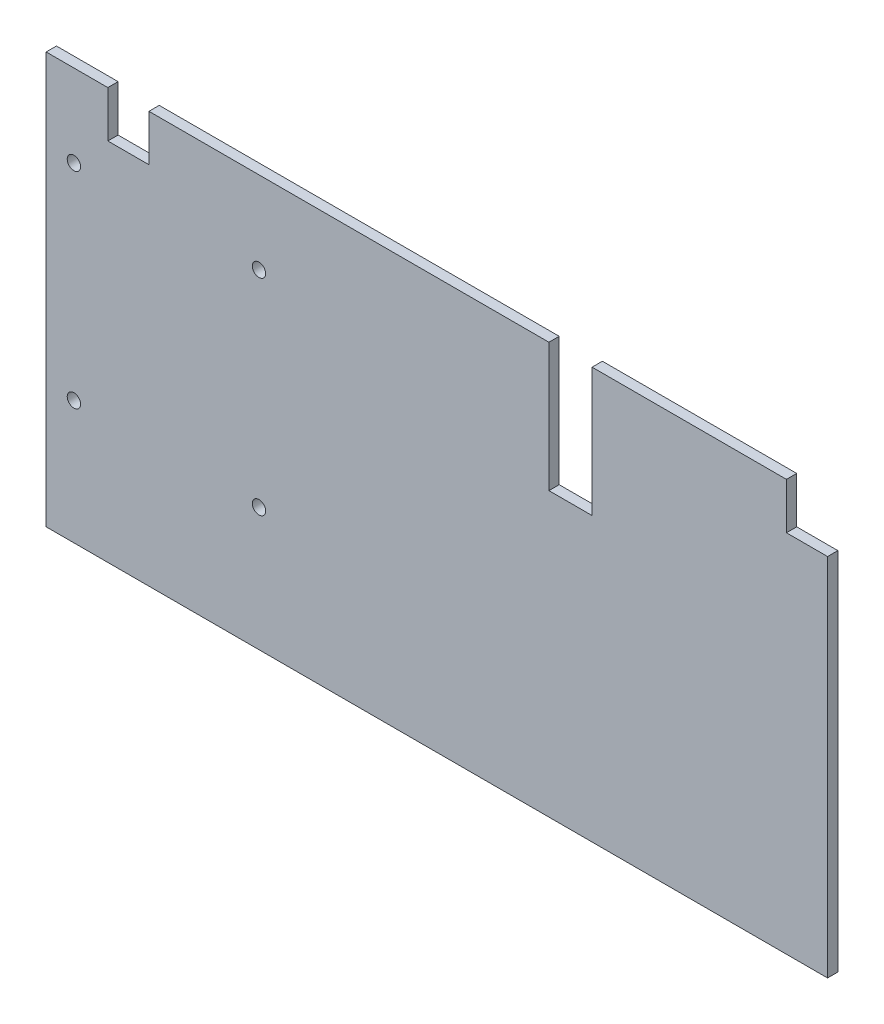
ISO-10303-21;
HEADER;
FILE_DESCRIPTION(('STEP AP214'),'2;1');
FILE_NAME('part.step','',(''),(''),'','','');
FILE_SCHEMA(('AUTOMOTIVE_DESIGN { 1 0 10303 214 1 1 1 1 }'));
ENDSEC;
DATA;
#1=APPLICATION_CONTEXT('core data for automotive mechanical design processes');
#2=APPLICATION_PROTOCOL_DEFINITION('international standard','automotive_design',2000,#1);
#3=PRODUCT_CONTEXT('',#1,'mechanical');
#4=PRODUCT('Part','Part','',(#3));
#5=PRODUCT_RELATED_PRODUCT_CATEGORY('part','',(#4));
#6=PRODUCT_DEFINITION_FORMATION('','',#4);
#7=PRODUCT_DEFINITION_CONTEXT('part definition',#1,'design');
#8=PRODUCT_DEFINITION('design','',#6,#7);
#9=PRODUCT_DEFINITION_SHAPE('','',#8);
#10=(LENGTH_UNIT() NAMED_UNIT(*) SI_UNIT(.MILLI.,.METRE.));
#11=(NAMED_UNIT(*) PLANE_ANGLE_UNIT() SI_UNIT($,.RADIAN.));
#12=(NAMED_UNIT(*) SI_UNIT($,.STERADIAN.) SOLID_ANGLE_UNIT());
#13=UNCERTAINTY_MEASURE_WITH_UNIT(LENGTH_MEASURE(1.E-05),#10,'distance_accuracy_value','');
#14=(GEOMETRIC_REPRESENTATION_CONTEXT(3) GLOBAL_UNCERTAINTY_ASSIGNED_CONTEXT((#13)) GLOBAL_UNIT_ASSIGNED_CONTEXT((#10,
#11,#12)) REPRESENTATION_CONTEXT('',''));
#15=CARTESIAN_POINT('',(0.,0.,0.));
#16=DIRECTION('',(0.,0.,1.));
#17=DIRECTION('',(1.,0.,0.));
#18=AXIS2_PLACEMENT_3D('',#15,#16,#17);
#19=CARTESIAN_POINT('',(0.,0.,10.));
#20=DIRECTION('',(0.,0.,1.));
#21=DIRECTION('',(1.,0.,0.));
#22=AXIS2_PLACEMENT_3D('',#19,#20,#21);
#23=PLANE('',#22);
#24=CARTESIAN_POINT('',(-303.,-100.,10.));
#25=DIRECTION('',(0.,0.,1.));
#26=DIRECTION('',(-1.,0.,0.));
#27=AXIS2_PLACEMENT_3D('',#24,#25,#26);
#28=CIRCLE('',#27,6.50000000000002);
#29=CARTESIAN_POINT('',(-309.5,-100.,10.));
#30=VERTEX_POINT('',#29);
#31=EDGE_CURVE('E320',#30,#30,#28,.T.);
#32=ORIENTED_EDGE('',*,*,#31,.F.);
#33=EDGE_LOOP('',(#32));
#34=FACE_BOUND('',#33,.T.);
#35=CARTESIAN_POINT('',(-303.,100.,10.));
#36=DIRECTION('',(0.,0.,1.));
#37=DIRECTION('',(1.,0.,0.));
#38=AXIS2_PLACEMENT_3D('',#35,#36,#37);
#39=CIRCLE('',#38,6.50000000000002);
#40=CARTESIAN_POINT('',(-296.5,100.,10.));
#41=VERTEX_POINT('',#40);
#42=EDGE_CURVE('E173',#41,#41,#39,.T.);
#43=ORIENTED_EDGE('',*,*,#42,.F.);
#44=EDGE_LOOP('',(#43));
#45=FACE_BOUND('',#44,.T.);
#46=DIRECTION('',(0.,1.,0.));
#47=VECTOR('',#46,1.);
#48=CARTESIAN_POINT('',(-20.9999999999999,55.,10.));
#49=LINE('',#48,#47);
#50=CARTESIAN_POINT('',(-20.9999999999999,55.,10.));
#51=VERTEX_POINT('',#50);
#52=CARTESIAN_POINT('',(-21.,180.,10.));
#53=VERTEX_POINT('',#52);
#54=EDGE_CURVE('E196',#51,#53,#49,.T.);
#55=ORIENTED_EDGE('',*,*,#54,.T.);
#56=DIRECTION('',(-1.,0.,0.));
#57=VECTOR('',#56,1.);
#58=CARTESIAN_POINT('',(-21.,180.,10.));
#59=LINE('',#58,#57);
#60=CARTESIAN_POINT('',(-410.,180.,10.));
#61=VERTEX_POINT('',#60);
#62=EDGE_CURVE('E114',#53,#61,#59,.T.);
#63=ORIENTED_EDGE('',*,*,#62,.T.);
#64=DIRECTION('',(0.,-1.,0.));
#65=VECTOR('',#64,1.);
#66=CARTESIAN_POINT('',(-410.,180.,10.));
#67=LINE('',#66,#65);
#68=CARTESIAN_POINT('',(-410.,135.,10.));
#69=VERTEX_POINT('',#68);
#70=EDGE_CURVE('E229',#61,#69,#67,.T.);
#71=ORIENTED_EDGE('',*,*,#70,.T.);
#72=DIRECTION('',(-1.,0.,0.));
#73=VECTOR('',#72,1.);
#74=CARTESIAN_POINT('',(-410.,135.,10.));
#75=LINE('',#74,#73);
#76=CARTESIAN_POINT('',(-450.,135.,10.));
#77=VERTEX_POINT('',#76);
#78=EDGE_CURVE('E248',#69,#77,#75,.T.);
#79=ORIENTED_EDGE('',*,*,#78,.T.);
#80=DIRECTION('',(0.,1.,0.));
#81=VECTOR('',#80,1.);
#82=CARTESIAN_POINT('',(-450.,135.,10.));
#83=LINE('',#82,#81);
#84=CARTESIAN_POINT('',(-450.,180.,10.));
#85=VERTEX_POINT('',#84);
#86=EDGE_CURVE('E245',#77,#85,#83,.T.);
#87=ORIENTED_EDGE('',*,*,#86,.T.);
#88=DIRECTION('',(-1.,0.,0.));
#89=VECTOR('',#88,1.);
#90=CARTESIAN_POINT('',(-450.,180.,10.));
#91=LINE('',#90,#89);
#92=CARTESIAN_POINT('',(-510.,180.,10.));
#93=VERTEX_POINT('',#92);
#94=EDGE_CURVE('E247',#85,#93,#91,.T.);
#95=ORIENTED_EDGE('',*,*,#94,.T.);
#96=DIRECTION('',(0.,-1.,0.));
#97=VECTOR('',#96,1.);
#98=CARTESIAN_POINT('',(-510.,180.,10.));
#99=LINE('',#98,#97);
#100=CARTESIAN_POINT('',(-510.,-220.,10.));
#101=VERTEX_POINT('',#100);
#102=EDGE_CURVE('E250',#93,#101,#99,.T.);
#103=ORIENTED_EDGE('',*,*,#102,.T.);
#104=DIRECTION('',(1.,0.,0.));
#105=VECTOR('',#104,1.);
#106=CARTESIAN_POINT('',(-510.,-220.,10.));
#107=LINE('',#106,#105);
#108=CARTESIAN_POINT('',(250.,-220.,10.));
#109=VERTEX_POINT('',#108);
#110=EDGE_CURVE('E256',#101,#109,#107,.T.);
#111=ORIENTED_EDGE('',*,*,#110,.T.);
#112=DIRECTION('',(0.,1.,0.));
#113=VECTOR('',#112,1.);
#114=CARTESIAN_POINT('',(250.,135.,10.));
#115=LINE('',#114,#113);
#116=CARTESIAN_POINT('',(250.,135.,10.));
#117=VERTEX_POINT('',#116);
#118=EDGE_CURVE('E258',#109,#117,#115,.T.);
#119=ORIENTED_EDGE('',*,*,#118,.T.);
#120=DIRECTION('',(-1.,0.,0.));
#121=VECTOR('',#120,1.);
#122=CARTESIAN_POINT('',(210.,135.,10.));
#123=LINE('',#122,#121);
#124=CARTESIAN_POINT('',(210.,135.,10.));
#125=VERTEX_POINT('',#124);
#126=EDGE_CURVE('E260',#117,#125,#123,.T.);
#127=ORIENTED_EDGE('',*,*,#126,.T.);
#128=DIRECTION('',(0.,1.,0.));
#129=VECTOR('',#128,1.);
#130=CARTESIAN_POINT('',(210.,180.,10.));
#131=LINE('',#130,#129);
#132=CARTESIAN_POINT('',(210.,180.,10.));
#133=VERTEX_POINT('',#132);
#134=EDGE_CURVE('E151',#125,#133,#131,.T.);
#135=ORIENTED_EDGE('',*,*,#134,.T.);
#136=DIRECTION('',(-1.,0.,0.));
#137=VECTOR('',#136,1.);
#138=CARTESIAN_POINT('',(21.,180.,10.));
#139=LINE('',#138,#137);
#140=CARTESIAN_POINT('',(21.,180.,10.));
#141=VERTEX_POINT('',#140);
#142=EDGE_CURVE('E145',#133,#141,#139,.T.);
#143=ORIENTED_EDGE('',*,*,#142,.T.);
#144=DIRECTION('',(0.,-1.,0.));
#145=VECTOR('',#144,1.);
#146=CARTESIAN_POINT('',(21.0000000000001,55.,10.));
#147=LINE('',#146,#145);
#148=CARTESIAN_POINT('',(21.0000000000001,55.,10.));
#149=VERTEX_POINT('',#148);
#150=EDGE_CURVE('E149',#141,#149,#147,.T.);
#151=ORIENTED_EDGE('',*,*,#150,.T.);
#152=DIRECTION('',(-1.,0.,0.));
#153=VECTOR('',#152,1.);
#154=CARTESIAN_POINT('',(-20.9999999999999,55.,10.));
#155=LINE('',#154,#153);
#156=EDGE_CURVE('E53',#149,#51,#155,.T.);
#157=ORIENTED_EDGE('',*,*,#156,.T.);
#158=EDGE_LOOP('',(#55,#63,#71,#79,#87,#95,#103,#111,#119,#127,#135,#143,#151,#157));
#159=FACE_BOUND('',#158,.T.);
#160=CARTESIAN_POINT('',(-483.,100.,10.));
#161=DIRECTION('',(0.,0.,1.));
#162=DIRECTION('',(-1.,0.,0.));
#163=AXIS2_PLACEMENT_3D('',#160,#161,#162);
#164=CIRCLE('',#163,6.50000000000002);
#165=CARTESIAN_POINT('',(-489.5,100.,10.));
#166=VERTEX_POINT('',#165);
#167=EDGE_CURVE('E326',#166,#166,#164,.T.);
#168=ORIENTED_EDGE('',*,*,#167,.F.);
#169=EDGE_LOOP('',(#168));
#170=FACE_BOUND('',#169,.T.);
#171=CARTESIAN_POINT('',(-483.,-100.,10.));
#172=DIRECTION('',(0.,0.,1.));
#173=DIRECTION('',(1.,0.,0.));
#174=AXIS2_PLACEMENT_3D('',#171,#172,#173);
#175=CIRCLE('',#174,6.50000000000002);
#176=CARTESIAN_POINT('',(-476.5,-100.,10.));
#177=VERTEX_POINT('',#176);
#178=EDGE_CURVE('E311',#177,#177,#175,.T.);
#179=ORIENTED_EDGE('',*,*,#178,.F.);
#180=EDGE_LOOP('',(#179));
#181=FACE_BOUND('',#180,.T.);
#182=ADVANCED_FACE('F36',(#34,#45,#159,#170,#181),#23,.T.);
#183=CARTESIAN_POINT('',(0.,0.,0.));
#184=DIRECTION('',(0.,0.,1.));
#185=DIRECTION('',(1.,0.,0.));
#186=AXIS2_PLACEMENT_3D('',#183,#184,#185);
#187=PLANE('',#186);
#188=DIRECTION('',(0.,1.,0.));
#189=VECTOR('',#188,1.);
#190=CARTESIAN_POINT('',(-20.9999999999999,55.,0.));
#191=LINE('',#190,#189);
#192=CARTESIAN_POINT('',(-20.9999999999999,55.,0.));
#193=VERTEX_POINT('',#192);
#194=CARTESIAN_POINT('',(-21.,180.,0.));
#195=VERTEX_POINT('',#194);
#196=EDGE_CURVE('E169',#193,#195,#191,.T.);
#197=ORIENTED_EDGE('',*,*,#196,.F.);
#198=DIRECTION('',(-1.,0.,0.));
#199=VECTOR('',#198,1.);
#200=CARTESIAN_POINT('',(-20.9999999999999,55.,0.));
#201=LINE('',#200,#199);
#202=CARTESIAN_POINT('',(21.0000000000001,55.,0.));
#203=VERTEX_POINT('',#202);
#204=EDGE_CURVE('E106',#203,#193,#201,.T.);
#205=ORIENTED_EDGE('',*,*,#204,.F.);
#206=DIRECTION('',(0.,-1.,0.));
#207=VECTOR('',#206,1.);
#208=CARTESIAN_POINT('',(21.0000000000001,55.,0.));
#209=LINE('',#208,#207);
#210=CARTESIAN_POINT('',(21.,180.,0.));
#211=VERTEX_POINT('',#210);
#212=EDGE_CURVE('E100',#211,#203,#209,.T.);
#213=ORIENTED_EDGE('',*,*,#212,.F.);
#214=DIRECTION('',(-1.,0.,0.));
#215=VECTOR('',#214,1.);
#216=CARTESIAN_POINT('',(21.,180.,0.));
#217=LINE('',#216,#215);
#218=CARTESIAN_POINT('',(210.,180.,0.));
#219=VERTEX_POINT('',#218);
#220=EDGE_CURVE('E159',#219,#211,#217,.T.);
#221=ORIENTED_EDGE('',*,*,#220,.F.);
#222=DIRECTION('',(0.,1.,0.));
#223=VECTOR('',#222,1.);
#224=CARTESIAN_POINT('',(210.,180.,0.));
#225=LINE('',#224,#223);
#226=CARTESIAN_POINT('',(210.,135.,0.));
#227=VERTEX_POINT('',#226);
#228=EDGE_CURVE('E191',#227,#219,#225,.T.);
#229=ORIENTED_EDGE('',*,*,#228,.F.);
#230=DIRECTION('',(-1.,0.,0.));
#231=VECTOR('',#230,1.);
#232=CARTESIAN_POINT('',(210.,135.,0.));
#233=LINE('',#232,#231);
#234=CARTESIAN_POINT('',(250.,135.,0.));
#235=VERTEX_POINT('',#234);
#236=EDGE_CURVE('E189',#235,#227,#233,.T.);
#237=ORIENTED_EDGE('',*,*,#236,.F.);
#238=DIRECTION('',(0.,1.,0.));
#239=VECTOR('',#238,1.);
#240=CARTESIAN_POINT('',(250.,135.,0.));
#241=LINE('',#240,#239);
#242=CARTESIAN_POINT('',(250.,-220.,0.));
#243=VERTEX_POINT('',#242);
#244=EDGE_CURVE('E187',#243,#235,#241,.T.);
#245=ORIENTED_EDGE('',*,*,#244,.F.);
#246=DIRECTION('',(1.,0.,0.));
#247=VECTOR('',#246,1.);
#248=CARTESIAN_POINT('',(-510.,-220.,0.));
#249=LINE('',#248,#247);
#250=CARTESIAN_POINT('',(-510.,-220.,0.));
#251=VERTEX_POINT('',#250);
#252=EDGE_CURVE('E185',#251,#243,#249,.T.);
#253=ORIENTED_EDGE('',*,*,#252,.F.);
#254=DIRECTION('',(0.,-1.,0.));
#255=VECTOR('',#254,1.);
#256=CARTESIAN_POINT('',(-510.,180.,0.));
#257=LINE('',#256,#255);
#258=CARTESIAN_POINT('',(-510.,180.,0.));
#259=VERTEX_POINT('',#258);
#260=EDGE_CURVE('E183',#259,#251,#257,.T.);
#261=ORIENTED_EDGE('',*,*,#260,.F.);
#262=DIRECTION('',(-1.,0.,0.));
#263=VECTOR('',#262,1.);
#264=CARTESIAN_POINT('',(-450.,180.,0.));
#265=LINE('',#264,#263);
#266=CARTESIAN_POINT('',(-450.,180.,0.));
#267=VERTEX_POINT('',#266);
#268=EDGE_CURVE('E181',#267,#259,#265,.T.);
#269=ORIENTED_EDGE('',*,*,#268,.F.);
#270=DIRECTION('',(0.,1.,0.));
#271=VECTOR('',#270,1.);
#272=CARTESIAN_POINT('',(-450.,135.,0.));
#273=LINE('',#272,#271);
#274=CARTESIAN_POINT('',(-450.,135.,0.));
#275=VERTEX_POINT('',#274);
#276=EDGE_CURVE('E179',#275,#267,#273,.T.);
#277=ORIENTED_EDGE('',*,*,#276,.F.);
#278=DIRECTION('',(-1.,0.,0.));
#279=VECTOR('',#278,1.);
#280=CARTESIAN_POINT('',(-410.,135.,0.));
#281=LINE('',#280,#279);
#282=CARTESIAN_POINT('',(-410.,135.,0.));
#283=VERTEX_POINT('',#282);
#284=EDGE_CURVE('E177',#283,#275,#281,.T.);
#285=ORIENTED_EDGE('',*,*,#284,.F.);
#286=DIRECTION('',(0.,-1.,0.));
#287=VECTOR('',#286,1.);
#288=CARTESIAN_POINT('',(-410.,180.,0.));
#289=LINE('',#288,#287);
#290=CARTESIAN_POINT('',(-410.,180.,0.));
#291=VERTEX_POINT('',#290);
#292=EDGE_CURVE('E175',#291,#283,#289,.T.);
#293=ORIENTED_EDGE('',*,*,#292,.F.);
#294=DIRECTION('',(-1.,0.,0.));
#295=VECTOR('',#294,1.);
#296=CARTESIAN_POINT('',(-21.,180.,0.));
#297=LINE('',#296,#295);
#298=EDGE_CURVE('E172',#195,#291,#297,.T.);
#299=ORIENTED_EDGE('',*,*,#298,.F.);
#300=EDGE_LOOP('',(#197,#205,#213,#221,#229,#237,#245,#253,#261,#269,#277,#285,#293,#299));
#301=FACE_BOUND('',#300,.T.);
#302=CARTESIAN_POINT('',(-303.,100.,0.));
#303=DIRECTION('',(0.,0.,1.));
#304=DIRECTION('',(1.,0.,0.));
#305=AXIS2_PLACEMENT_3D('',#302,#303,#304);
#306=CIRCLE('',#305,6.50000000000002);
#307=CARTESIAN_POINT('',(-296.5,100.,0.));
#308=VERTEX_POINT('',#307);
#309=EDGE_CURVE('E329',#308,#308,#306,.T.);
#310=ORIENTED_EDGE('',*,*,#309,.T.);
#311=EDGE_LOOP('',(#310));
#312=FACE_BOUND('',#311,.T.);
#313=CARTESIAN_POINT('',(-483.,100.,0.));
#314=DIRECTION('',(0.,0.,1.));
#315=DIRECTION('',(-1.,0.,0.));
#316=AXIS2_PLACEMENT_3D('',#313,#314,#315);
#317=CIRCLE('',#316,6.50000000000002);
#318=CARTESIAN_POINT('',(-489.5,100.,0.));
#319=VERTEX_POINT('',#318);
#320=EDGE_CURVE('E323',#319,#319,#317,.T.);
#321=ORIENTED_EDGE('',*,*,#320,.T.);
#322=EDGE_LOOP('',(#321));
#323=FACE_BOUND('',#322,.T.);
#324=CARTESIAN_POINT('',(-303.,-100.,0.));
#325=DIRECTION('',(0.,0.,1.));
#326=DIRECTION('',(-1.,0.,0.));
#327=AXIS2_PLACEMENT_3D('',#324,#325,#326);
#328=CIRCLE('',#327,6.50000000000002);
#329=CARTESIAN_POINT('',(-309.5,-100.,0.));
#330=VERTEX_POINT('',#329);
#331=EDGE_CURVE('E317',#330,#330,#328,.T.);
#332=ORIENTED_EDGE('',*,*,#331,.T.);
#333=EDGE_LOOP('',(#332));
#334=FACE_BOUND('',#333,.T.);
#335=CARTESIAN_POINT('',(-483.,-100.,0.));
#336=DIRECTION('',(0.,0.,1.));
#337=DIRECTION('',(1.,0.,0.));
#338=AXIS2_PLACEMENT_3D('',#335,#336,#337);
#339=CIRCLE('',#338,6.50000000000002);
#340=CARTESIAN_POINT('',(-476.5,-100.,0.));
#341=VERTEX_POINT('',#340);
#342=EDGE_CURVE('E314',#341,#341,#339,.T.);
#343=ORIENTED_EDGE('',*,*,#342,.T.);
#344=EDGE_LOOP('',(#343));
#345=FACE_BOUND('',#344,.T.);
#346=ADVANCED_FACE('F233',(#301,#312,#323,#334,#345),#187,.F.);
#347=CARTESIAN_POINT('',(-20.9999999999999,55.,10.));
#348=DIRECTION('',(-1.,0.,0.));
#349=DIRECTION('',(0.,-1.,0.));
#350=AXIS2_PLACEMENT_3D('',#347,#348,#349);
#351=PLANE('',#350);
#352=ORIENTED_EDGE('',*,*,#196,.T.);
#353=DIRECTION('',(0.,0.,-1.));
#354=VECTOR('',#353,1.);
#355=CARTESIAN_POINT('',(-21.,180.,10.));
#356=LINE('',#355,#354);
#357=EDGE_CURVE('E11',#53,#195,#356,.T.);
#358=ORIENTED_EDGE('',*,*,#357,.F.);
#359=ORIENTED_EDGE('',*,*,#54,.F.);
#360=DIRECTION('',(0.,0.,-1.));
#361=VECTOR('',#360,1.);
#362=CARTESIAN_POINT('',(-20.9999999999999,55.,10.));
#363=LINE('',#362,#361);
#364=EDGE_CURVE('E165',#51,#193,#363,.T.);
#365=ORIENTED_EDGE('',*,*,#364,.T.);
#366=EDGE_LOOP('',(#352,#358,#359,#365));
#367=FACE_BOUND('',#366,.T.);
#368=ADVANCED_FACE('F38',(#367),#351,.F.);
#369=CARTESIAN_POINT('',(-21.,180.,10.));
#370=DIRECTION('',(0.,-1.,0.));
#371=DIRECTION('',(1.,0.,0.));
#372=AXIS2_PLACEMENT_3D('',#369,#370,#371);
#373=PLANE('',#372);
#374=ORIENTED_EDGE('',*,*,#298,.T.);
#375=DIRECTION('',(0.,0.,-1.));
#376=VECTOR('',#375,1.);
#377=CARTESIAN_POINT('',(-410.,180.,10.));
#378=LINE('',#377,#376);
#379=EDGE_CURVE('E45',#61,#291,#378,.T.);
#380=ORIENTED_EDGE('',*,*,#379,.F.);
#381=ORIENTED_EDGE('',*,*,#62,.F.);
#382=ORIENTED_EDGE('',*,*,#357,.T.);
#383=EDGE_LOOP('',(#374,#380,#381,#382));
#384=FACE_BOUND('',#383,.T.);
#385=ADVANCED_FACE('F459',(#384),#373,.F.);
#386=CARTESIAN_POINT('',(-410.,180.,10.));
#387=DIRECTION('',(1.,0.,0.));
#388=DIRECTION('',(0.,0.,-1.));
#389=AXIS2_PLACEMENT_3D('',#386,#387,#388);
#390=PLANE('',#389);
#391=ORIENTED_EDGE('',*,*,#292,.T.);
#392=DIRECTION('',(0.,0.,-1.));
#393=VECTOR('',#392,1.);
#394=CARTESIAN_POINT('',(-410.,135.,10.));
#395=LINE('',#394,#393);
#396=EDGE_CURVE('E221',#69,#283,#395,.T.);
#397=ORIENTED_EDGE('',*,*,#396,.F.);
#398=ORIENTED_EDGE('',*,*,#70,.F.);
#399=ORIENTED_EDGE('',*,*,#379,.T.);
#400=EDGE_LOOP('',(#391,#397,#398,#399));
#401=FACE_BOUND('',#400,.T.);
#402=ADVANCED_FACE('F227',(#401),#390,.F.);
#403=CARTESIAN_POINT('',(-410.,135.,10.));
#404=DIRECTION('',(0.,-1.,0.));
#405=DIRECTION('',(0.,0.,-1.));
#406=AXIS2_PLACEMENT_3D('',#403,#404,#405);
#407=PLANE('',#406);
#408=ORIENTED_EDGE('',*,*,#284,.T.);
#409=DIRECTION('',(0.,0.,-1.));
#410=VECTOR('',#409,1.);
#411=CARTESIAN_POINT('',(-450.,135.,10.));
#412=LINE('',#411,#410);
#413=EDGE_CURVE('E218',#77,#275,#412,.T.);
#414=ORIENTED_EDGE('',*,*,#413,.F.);
#415=ORIENTED_EDGE('',*,*,#78,.F.);
#416=ORIENTED_EDGE('',*,*,#396,.T.);
#417=EDGE_LOOP('',(#408,#414,#415,#416));
#418=FACE_BOUND('',#417,.T.);
#419=ADVANCED_FACE('F239',(#418),#407,.F.);
#420=CARTESIAN_POINT('',(-450.,135.,10.));
#421=DIRECTION('',(-1.,0.,0.));
#422=DIRECTION('',(0.,0.,1.));
#423=AXIS2_PLACEMENT_3D('',#420,#421,#422);
#424=PLANE('',#423);
#425=ORIENTED_EDGE('',*,*,#276,.T.);
#426=DIRECTION('',(0.,0.,-1.));
#427=VECTOR('',#426,1.);
#428=CARTESIAN_POINT('',(-450.,180.,10.));
#429=LINE('',#428,#427);
#430=EDGE_CURVE('E215',#85,#267,#429,.T.);
#431=ORIENTED_EDGE('',*,*,#430,.F.);
#432=ORIENTED_EDGE('',*,*,#86,.F.);
#433=ORIENTED_EDGE('',*,*,#413,.T.);
#434=EDGE_LOOP('',(#425,#431,#432,#433));
#435=FACE_BOUND('',#434,.T.);
#436=ADVANCED_FACE('F243',(#435),#424,.F.);
#437=CARTESIAN_POINT('',(-450.,180.,10.));
#438=DIRECTION('',(0.,-1.,0.));
#439=DIRECTION('',(0.,0.,-1.));
#440=AXIS2_PLACEMENT_3D('',#437,#438,#439);
#441=PLANE('',#440);
#442=ORIENTED_EDGE('',*,*,#268,.T.);
#443=DIRECTION('',(0.,0.,-1.));
#444=VECTOR('',#443,1.);
#445=CARTESIAN_POINT('',(-510.,180.,10.));
#446=LINE('',#445,#444);
#447=EDGE_CURVE('E212',#93,#259,#446,.T.);
#448=ORIENTED_EDGE('',*,*,#447,.F.);
#449=ORIENTED_EDGE('',*,*,#94,.F.);
#450=ORIENTED_EDGE('',*,*,#430,.T.);
#451=EDGE_LOOP('',(#442,#448,#449,#450));
#452=FACE_BOUND('',#451,.T.);
#453=ADVANCED_FACE('F424',(#452),#441,.F.);
#454=CARTESIAN_POINT('',(-510.,180.,10.));
#455=DIRECTION('',(1.,0.,0.));
#456=DIRECTION('',(0.,0.,-1.));
#457=AXIS2_PLACEMENT_3D('',#454,#455,#456);
#458=PLANE('',#457);
#459=ORIENTED_EDGE('',*,*,#260,.T.);
#460=DIRECTION('',(0.,0.,-1.));
#461=VECTOR('',#460,1.);
#462=CARTESIAN_POINT('',(-510.,-220.,10.));
#463=LINE('',#462,#461);
#464=EDGE_CURVE('E209',#101,#251,#463,.T.);
#465=ORIENTED_EDGE('',*,*,#464,.F.);
#466=ORIENTED_EDGE('',*,*,#102,.F.);
#467=ORIENTED_EDGE('',*,*,#447,.T.);
#468=EDGE_LOOP('',(#459,#465,#466,#467));
#469=FACE_BOUND('',#468,.T.);
#470=ADVANCED_FACE('F414',(#469),#458,.F.);
#471=CARTESIAN_POINT('',(-510.,-220.,10.));
#472=DIRECTION('',(0.,1.,0.));
#473=DIRECTION('',(0.,0.,1.));
#474=AXIS2_PLACEMENT_3D('',#471,#472,#473);
#475=PLANE('',#474);
#476=ORIENTED_EDGE('',*,*,#252,.T.);
#477=DIRECTION('',(0.,0.,-1.));
#478=VECTOR('',#477,1.);
#479=CARTESIAN_POINT('',(250.,-220.,10.));
#480=LINE('',#479,#478);
#481=EDGE_CURVE('E206',#109,#243,#480,.T.);
#482=ORIENTED_EDGE('',*,*,#481,.F.);
#483=ORIENTED_EDGE('',*,*,#110,.F.);
#484=ORIENTED_EDGE('',*,*,#464,.T.);
#485=EDGE_LOOP('',(#476,#482,#483,#484));
#486=FACE_BOUND('',#485,.T.);
#487=ADVANCED_FACE('F404',(#486),#475,.F.);
#488=CARTESIAN_POINT('',(250.,135.,10.));
#489=DIRECTION('',(-1.,0.,0.));
#490=DIRECTION('',(0.,-1.,0.));
#491=AXIS2_PLACEMENT_3D('',#488,#489,#490);
#492=PLANE('',#491);
#493=ORIENTED_EDGE('',*,*,#244,.T.);
#494=DIRECTION('',(0.,0.,-1.));
#495=VECTOR('',#494,1.);
#496=CARTESIAN_POINT('',(250.,135.,10.));
#497=LINE('',#496,#495);
#498=EDGE_CURVE('E203',#117,#235,#497,.T.);
#499=ORIENTED_EDGE('',*,*,#498,.F.);
#500=ORIENTED_EDGE('',*,*,#118,.F.);
#501=ORIENTED_EDGE('',*,*,#481,.T.);
#502=EDGE_LOOP('',(#493,#499,#500,#501));
#503=FACE_BOUND('',#502,.T.);
#504=ADVANCED_FACE('F395',(#503),#492,.F.);
#505=CARTESIAN_POINT('',(210.,135.,10.));
#506=DIRECTION('',(0.,-1.,0.));
#507=DIRECTION('',(0.,0.,-1.));
#508=AXIS2_PLACEMENT_3D('',#505,#506,#507);
#509=PLANE('',#508);
#510=ORIENTED_EDGE('',*,*,#236,.T.);
#511=DIRECTION('',(0.,0.,-1.));
#512=VECTOR('',#511,1.);
#513=CARTESIAN_POINT('',(210.,135.,10.));
#514=LINE('',#513,#512);
#515=EDGE_CURVE('E200',#125,#227,#514,.T.);
#516=ORIENTED_EDGE('',*,*,#515,.F.);
#517=ORIENTED_EDGE('',*,*,#126,.F.);
#518=ORIENTED_EDGE('',*,*,#498,.T.);
#519=EDGE_LOOP('',(#510,#516,#517,#518));
#520=FACE_BOUND('',#519,.T.);
#521=ADVANCED_FACE('F266',(#520),#509,.F.);
#522=CARTESIAN_POINT('',(210.,180.,10.));
#523=DIRECTION('',(-1.,0.,0.));
#524=DIRECTION('',(0.,-1.,0.));
#525=AXIS2_PLACEMENT_3D('',#522,#523,#524);
#526=PLANE('',#525);
#527=ORIENTED_EDGE('',*,*,#228,.T.);
#528=DIRECTION('',(0.,0.,-1.));
#529=VECTOR('',#528,1.);
#530=CARTESIAN_POINT('',(210.,180.,10.));
#531=LINE('',#530,#529);
#532=EDGE_CURVE('E160',#133,#219,#531,.T.);
#533=ORIENTED_EDGE('',*,*,#532,.F.);
#534=ORIENTED_EDGE('',*,*,#134,.F.);
#535=ORIENTED_EDGE('',*,*,#515,.T.);
#536=EDGE_LOOP('',(#527,#533,#534,#535));
#537=FACE_BOUND('',#536,.T.);
#538=ADVANCED_FACE('F270',(#537),#526,.F.);
#539=CARTESIAN_POINT('',(21.,180.,10.));
#540=DIRECTION('',(0.,-1.,0.));
#541=DIRECTION('',(0.,0.,-1.));
#542=AXIS2_PLACEMENT_3D('',#539,#540,#541);
#543=PLANE('',#542);
#544=ORIENTED_EDGE('',*,*,#220,.T.);
#545=DIRECTION('',(0.,0.,-1.));
#546=VECTOR('',#545,1.);
#547=CARTESIAN_POINT('',(21.,180.,10.));
#548=LINE('',#547,#546);
#549=EDGE_CURVE('E156',#141,#211,#548,.T.);
#550=ORIENTED_EDGE('',*,*,#549,.F.);
#551=ORIENTED_EDGE('',*,*,#142,.F.);
#552=ORIENTED_EDGE('',*,*,#532,.T.);
#553=EDGE_LOOP('',(#544,#550,#551,#552));
#554=FACE_BOUND('',#553,.T.);
#555=ADVANCED_FACE('F157',(#554),#543,.F.);
#556=CARTESIAN_POINT('',(21.0000000000001,55.,10.));
#557=DIRECTION('',(1.,0.,0.));
#558=DIRECTION('',(0.,1.,0.));
#559=AXIS2_PLACEMENT_3D('',#556,#557,#558);
#560=PLANE('',#559);
#561=ORIENTED_EDGE('',*,*,#212,.T.);
#562=DIRECTION('',(0.,0.,-1.));
#563=VECTOR('',#562,1.);
#564=CARTESIAN_POINT('',(21.0000000000001,55.,10.));
#565=LINE('',#564,#563);
#566=EDGE_CURVE('E161',#149,#203,#565,.T.);
#567=ORIENTED_EDGE('',*,*,#566,.F.);
#568=ORIENTED_EDGE('',*,*,#150,.F.);
#569=ORIENTED_EDGE('',*,*,#549,.T.);
#570=EDGE_LOOP('',(#561,#567,#568,#569));
#571=FACE_BOUND('',#570,.T.);
#572=ADVANCED_FACE('F163',(#571),#560,.F.);
#573=CARTESIAN_POINT('',(-20.9999999999999,55.,10.));
#574=DIRECTION('',(0.,-1.,0.));
#575=DIRECTION('',(1.,0.,0.));
#576=AXIS2_PLACEMENT_3D('',#573,#574,#575);
#577=PLANE('',#576);
#578=ORIENTED_EDGE('',*,*,#204,.T.);
#579=ORIENTED_EDGE('',*,*,#364,.F.);
#580=ORIENTED_EDGE('',*,*,#156,.F.);
#581=ORIENTED_EDGE('',*,*,#566,.T.);
#582=EDGE_LOOP('',(#578,#579,#580,#581));
#583=FACE_BOUND('',#582,.T.);
#584=ADVANCED_FACE('F274',(#583),#577,.F.);
#585=CARTESIAN_POINT('',(-303.,100.,10.));
#586=DIRECTION('',(0.,0.,-1.));
#587=DIRECTION('',(-1.,0.,0.));
#588=AXIS2_PLACEMENT_3D('',#585,#586,#587);
#589=CYLINDRICAL_SURFACE('',#588,6.50000000000002);
#590=ORIENTED_EDGE('',*,*,#42,.T.);
#591=EDGE_LOOP('',(#590));
#592=FACE_BOUND('',#591,.T.);
#593=ORIENTED_EDGE('',*,*,#309,.F.);
#594=EDGE_LOOP('',(#593));
#595=FACE_BOUND('',#594,.T.);
#596=ADVANCED_FACE('F276',(#592,#595),#589,.F.);
#597=CARTESIAN_POINT('',(-483.,100.,10.));
#598=DIRECTION('',(0.,0.,-1.));
#599=DIRECTION('',(-1.,0.,0.));
#600=AXIS2_PLACEMENT_3D('',#597,#598,#599);
#601=CYLINDRICAL_SURFACE('',#600,6.50000000000002);
#602=ORIENTED_EDGE('',*,*,#167,.T.);
#603=EDGE_LOOP('',(#602));
#604=FACE_BOUND('',#603,.T.);
#605=ORIENTED_EDGE('',*,*,#320,.F.);
#606=EDGE_LOOP('',(#605));
#607=FACE_BOUND('',#606,.T.);
#608=ADVANCED_FACE('F282',(#604,#607),#601,.F.);
#609=CARTESIAN_POINT('',(-303.,-100.,10.));
#610=DIRECTION('',(0.,0.,-1.));
#611=DIRECTION('',(-1.,0.,0.));
#612=AXIS2_PLACEMENT_3D('',#609,#610,#611);
#613=CYLINDRICAL_SURFACE('',#612,6.50000000000002);
#614=ORIENTED_EDGE('',*,*,#31,.T.);
#615=EDGE_LOOP('',(#614));
#616=FACE_BOUND('',#615,.T.);
#617=ORIENTED_EDGE('',*,*,#331,.F.);
#618=EDGE_LOOP('',(#617));
#619=FACE_BOUND('',#618,.T.);
#620=ADVANCED_FACE('F298',(#616,#619),#613,.F.);
#621=CARTESIAN_POINT('',(-483.,-100.,10.));
#622=DIRECTION('',(0.,0.,-1.));
#623=DIRECTION('',(-1.,0.,0.));
#624=AXIS2_PLACEMENT_3D('',#621,#622,#623);
#625=CYLINDRICAL_SURFACE('',#624,6.50000000000002);
#626=ORIENTED_EDGE('',*,*,#178,.T.);
#627=EDGE_LOOP('',(#626));
#628=FACE_BOUND('',#627,.T.);
#629=ORIENTED_EDGE('',*,*,#342,.F.);
#630=EDGE_LOOP('',(#629));
#631=FACE_BOUND('',#630,.T.);
#632=ADVANCED_FACE('F302',(#628,#631),#625,.F.);
#633=CLOSED_SHELL('',(#182,#346,#368,#385,#402,#419,#436,#453,#470,#487,#504,#521,#538,#555,
#572,#584,#596,#608,#620,#632));
#634=MANIFOLD_SOLID_BREP('B2',#633);
#635=ADVANCED_BREP_SHAPE_REPRESENTATION('',(#18,#634),#14);
#636=SHAPE_DEFINITION_REPRESENTATION(#9,#635);
ENDSEC;
END-ISO-10303-21;
